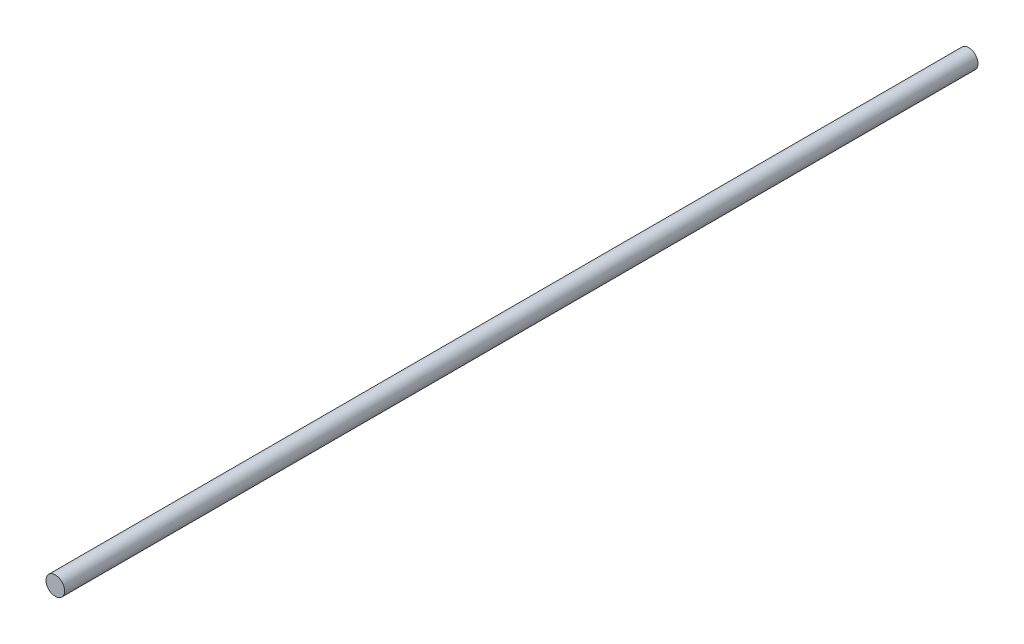
ISO-10303-21;
HEADER;
FILE_DESCRIPTION(('STEP AP214'),'2;1');
FILE_NAME('part.step','',(''),(''),'','','');
FILE_SCHEMA(('AUTOMOTIVE_DESIGN { 1 0 10303 214 1 1 1 1 }'));
ENDSEC;
DATA;
#1=APPLICATION_CONTEXT('core data for automotive mechanical design processes');
#2=APPLICATION_PROTOCOL_DEFINITION('international standard','automotive_design',2000,#1);
#3=PRODUCT_CONTEXT('',#1,'mechanical');
#4=PRODUCT('Part','Part','',(#3));
#5=PRODUCT_RELATED_PRODUCT_CATEGORY('part','',(#4));
#6=PRODUCT_DEFINITION_FORMATION('','',#4);
#7=PRODUCT_DEFINITION_CONTEXT('part definition',#1,'design');
#8=PRODUCT_DEFINITION('design','',#6,#7);
#9=PRODUCT_DEFINITION_SHAPE('','',#8);
#10=(LENGTH_UNIT() NAMED_UNIT(*) SI_UNIT(.MILLI.,.METRE.));
#11=(NAMED_UNIT(*) PLANE_ANGLE_UNIT() SI_UNIT($,.RADIAN.));
#12=(NAMED_UNIT(*) SI_UNIT($,.STERADIAN.) SOLID_ANGLE_UNIT());
#13=UNCERTAINTY_MEASURE_WITH_UNIT(LENGTH_MEASURE(1.E-05),#10,'distance_accuracy_value','');
#14=(GEOMETRIC_REPRESENTATION_CONTEXT(3) GLOBAL_UNCERTAINTY_ASSIGNED_CONTEXT((#13)) GLOBAL_UNIT_ASSIGNED_CONTEXT((#10,
#11,#12)) REPRESENTATION_CONTEXT('',''));
#15=CARTESIAN_POINT('',(0.,0.,0.));
#16=DIRECTION('',(0.,0.,1.));
#17=DIRECTION('',(1.,0.,0.));
#18=AXIS2_PLACEMENT_3D('',#15,#16,#17);
#19=CARTESIAN_POINT('',(0.,0.,980.));
#20=DIRECTION('',(0.,0.,-1.));
#21=DIRECTION('',(-1.,0.,0.));
#22=AXIS2_PLACEMENT_3D('',#19,#20,#21);
#23=CYLINDRICAL_SURFACE('',#22,10.);
#24=CARTESIAN_POINT('',(0.,0.,980.));
#25=DIRECTION('',(0.,0.,1.));
#26=DIRECTION('',(1.,0.,0.));
#27=AXIS2_PLACEMENT_3D('',#24,#25,#26);
#28=CIRCLE('',#27,10.);
#29=CARTESIAN_POINT('',(10.,0.,980.));
#30=VERTEX_POINT('',#29);
#31=EDGE_CURVE('E10',#30,#30,#28,.T.);
#32=ORIENTED_EDGE('',*,*,#31,.F.);
#33=EDGE_LOOP('',(#32));
#34=FACE_BOUND('',#33,.T.);
#35=CARTESIAN_POINT('',(0.,0.,0.));
#36=DIRECTION('',(0.,0.,1.));
#37=DIRECTION('',(1.,0.,0.));
#38=AXIS2_PLACEMENT_3D('',#35,#36,#37);
#39=CIRCLE('',#38,10.);
#40=CARTESIAN_POINT('',(10.,0.,0.));
#41=VERTEX_POINT('',#40);
#42=EDGE_CURVE('E44',#41,#41,#39,.T.);
#43=ORIENTED_EDGE('',*,*,#42,.T.);
#44=EDGE_LOOP('',(#43));
#45=FACE_BOUND('',#44,.T.);
#46=ADVANCED_FACE('F41',(#34,#45),#23,.T.);
#47=CARTESIAN_POINT('',(0.,0.,980.));
#48=DIRECTION('',(0.,0.,1.));
#49=DIRECTION('',(1.,0.,0.));
#50=AXIS2_PLACEMENT_3D('',#47,#48,#49);
#51=PLANE('',#50);
#52=ORIENTED_EDGE('',*,*,#31,.T.);
#53=EDGE_LOOP('',(#52));
#54=FACE_BOUND('',#53,.T.);
#55=ADVANCED_FACE('F58',(#54),#51,.T.);
#56=CARTESIAN_POINT('',(0.,0.,0.));
#57=DIRECTION('',(0.,0.,1.));
#58=DIRECTION('',(1.,0.,0.));
#59=AXIS2_PLACEMENT_3D('',#56,#57,#58);
#60=PLANE('',#59);
#61=ORIENTED_EDGE('',*,*,#42,.F.);
#62=EDGE_LOOP('',(#61));
#63=FACE_BOUND('',#62,.T.);
#64=ADVANCED_FACE('F56',(#63),#60,.F.);
#65=CLOSED_SHELL('',(#46,#55,#64));
#66=MANIFOLD_SOLID_BREP('B2',#65);
#67=ADVANCED_BREP_SHAPE_REPRESENTATION('',(#18,#66),#14);
#68=SHAPE_DEFINITION_REPRESENTATION(#9,#67);
ENDSEC;
END-ISO-10303-21;
